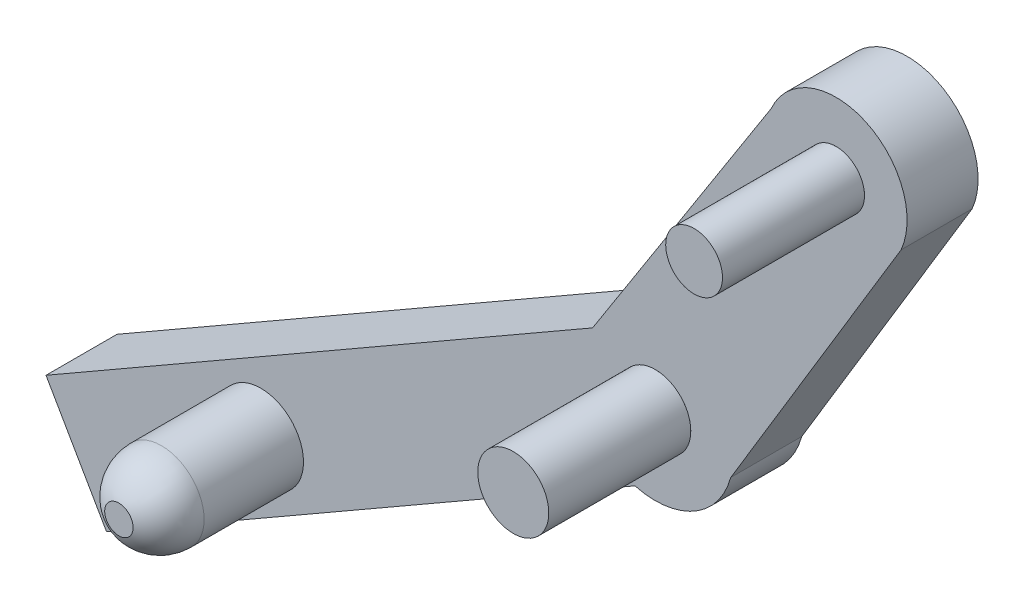
ISO-10303-21;
HEADER;
FILE_DESCRIPTION(('STEP AP214'),'2;1');
FILE_NAME('part.step','',(''),(''),'','','');
FILE_SCHEMA(('AUTOMOTIVE_DESIGN { 1 0 10303 214 1 1 1 1 }'));
ENDSEC;
DATA;
#1=APPLICATION_CONTEXT('core data for automotive mechanical design processes');
#2=APPLICATION_PROTOCOL_DEFINITION('international standard','automotive_design',2000,#1);
#3=PRODUCT_CONTEXT('',#1,'mechanical');
#4=PRODUCT('Part','Part','',(#3));
#5=PRODUCT_RELATED_PRODUCT_CATEGORY('part','',(#4));
#6=PRODUCT_DEFINITION_FORMATION('','',#4);
#7=PRODUCT_DEFINITION_CONTEXT('part definition',#1,'design');
#8=PRODUCT_DEFINITION('design','',#6,#7);
#9=PRODUCT_DEFINITION_SHAPE('','',#8);
#10=(LENGTH_UNIT() NAMED_UNIT(*) SI_UNIT(.MILLI.,.METRE.));
#11=(NAMED_UNIT(*) PLANE_ANGLE_UNIT() SI_UNIT($,.RADIAN.));
#12=(NAMED_UNIT(*) SI_UNIT($,.STERADIAN.) SOLID_ANGLE_UNIT());
#13=UNCERTAINTY_MEASURE_WITH_UNIT(LENGTH_MEASURE(1.E-05),#10,'distance_accuracy_value','');
#14=(GEOMETRIC_REPRESENTATION_CONTEXT(3) GLOBAL_UNCERTAINTY_ASSIGNED_CONTEXT((#13)) GLOBAL_UNIT_ASSIGNED_CONTEXT((#10,
#11,#12)) REPRESENTATION_CONTEXT('',''));
#15=CARTESIAN_POINT('',(0.,0.,0.));
#16=DIRECTION('',(0.,0.,1.));
#17=DIRECTION('',(1.,0.,0.));
#18=AXIS2_PLACEMENT_3D('',#15,#16,#17);
#19=CARTESIAN_POINT('',(2.48034743292827,-4.35301832543163,10.));
#20=DIRECTION('',(0.,0.,-1.));
#21=DIRECTION('',(1.,0.,0.));
#22=AXIS2_PLACEMENT_3D('',#19,#20,#21);
#23=CYLINDRICAL_SURFACE('',#22,2.5);
#24=CARTESIAN_POINT('',(2.48034743292827,-4.35301832543163,10.));
#25=DIRECTION('',(0.,0.,-1.));
#26=DIRECTION('',(-1.,0.,0.));
#27=AXIS2_PLACEMENT_3D('',#24,#25,#26);
#28=CIRCLE('',#27,2.5);
#29=CARTESIAN_POINT('',(-0.019652567071734,-4.35301832543163,10.));
#30=VERTEX_POINT('',#29);
#31=EDGE_CURVE('E11',#30,#30,#28,.T.);
#32=ORIENTED_EDGE('',*,*,#31,.T.);
#33=EDGE_LOOP('',(#32));
#34=FACE_BOUND('',#33,.T.);
#35=CARTESIAN_POINT('',(2.48034743292827,-4.35301832543163,0.));
#36=DIRECTION('',(0.,0.,-1.));
#37=DIRECTION('',(-1.,0.,0.));
#38=AXIS2_PLACEMENT_3D('',#35,#36,#37);
#39=CIRCLE('',#38,2.5);
#40=CARTESIAN_POINT('',(-0.019652567071734,-4.35301832543163,0.));
#41=VERTEX_POINT('',#40);
#42=EDGE_CURVE('E49',#41,#41,#39,.T.);
#43=ORIENTED_EDGE('',*,*,#42,.F.);
#44=EDGE_LOOP('',(#43));
#45=FACE_BOUND('',#44,.T.);
#46=ADVANCED_FACE('F46',(#34,#45),#23,.T.);
#47=CARTESIAN_POINT('',(2.48034743292827,-4.35301832543163,10.));
#48=DIRECTION('',(0.,0.,1.));
#49=DIRECTION('',(-1.,0.,0.));
#50=AXIS2_PLACEMENT_3D('',#47,#48,#49);
#51=PLANE('',#50);
#52=ORIENTED_EDGE('',*,*,#31,.F.);
#53=EDGE_LOOP('',(#52));
#54=FACE_BOUND('',#53,.T.);
#55=ADVANCED_FACE('F61',(#54),#51,.T.);
#56=CARTESIAN_POINT('',(2.48034743292827,-4.35301832543163,0.));
#57=DIRECTION('',(0.,0.,1.));
#58=DIRECTION('',(-1.,0.,0.));
#59=AXIS2_PLACEMENT_3D('',#56,#57,#58);
#60=PLANE('',#59);
#61=ORIENTED_EDGE('',*,*,#42,.T.);
#62=EDGE_LOOP('',(#61));
#63=FACE_BOUND('',#62,.T.);
#64=ADVANCED_FACE('F58',(#63),#60,.F.);
#65=CLOSED_SHELL('',(#46,#55,#64));
#66=MANIFOLD_SOLID_BREP('B2',#65);
#67=CARTESIAN_POINT('',(15.213151988496,16.1187767320416,10.));
#68=DIRECTION('',(0.,0.,-1.));
#69=DIRECTION('',(1.,0.,0.));
#70=AXIS2_PLACEMENT_3D('',#67,#68,#69);
#71=CYLINDRICAL_SURFACE('',#70,2.00000000004588);
#72=CARTESIAN_POINT('',(15.213151988496,16.1187767320416,10.));
#73=DIRECTION('',(0.,0.,-1.));
#74=DIRECTION('',(-1.,0.,0.));
#75=AXIS2_PLACEMENT_3D('',#72,#73,#74);
#76=CIRCLE('',#75,2.00000000004588);
#77=CARTESIAN_POINT('',(13.2131519884501,16.1187767320416,10.));
#78=VERTEX_POINT('',#77);
#79=EDGE_CURVE('E45',#78,#78,#76,.T.);
#80=ORIENTED_EDGE('',*,*,#79,.T.);
#81=EDGE_LOOP('',(#80));
#82=FACE_BOUND('',#81,.T.);
#83=CARTESIAN_POINT('',(15.213151988496,16.1187767320416,0.));
#84=DIRECTION('',(0.,0.,-1.));
#85=DIRECTION('',(-1.,0.,0.));
#86=AXIS2_PLACEMENT_3D('',#83,#84,#85);
#87=CIRCLE('',#86,2.00000000004588);
#88=CARTESIAN_POINT('',(13.2131519884501,16.1187767320416,0.));
#89=VERTEX_POINT('',#88);
#90=EDGE_CURVE('E99',#89,#89,#87,.T.);
#91=ORIENTED_EDGE('',*,*,#90,.F.);
#92=EDGE_LOOP('',(#91));
#93=FACE_BOUND('',#92,.T.);
#94=ADVANCED_FACE('F96',(#82,#93),#71,.T.);
#95=CARTESIAN_POINT('',(15.213151988496,16.1187767320416,10.));
#96=DIRECTION('',(0.,0.,1.));
#97=DIRECTION('',(-1.,0.,0.));
#98=AXIS2_PLACEMENT_3D('',#95,#96,#97);
#99=PLANE('',#98);
#100=ORIENTED_EDGE('',*,*,#79,.F.);
#101=EDGE_LOOP('',(#100));
#102=FACE_BOUND('',#101,.T.);
#103=ADVANCED_FACE('F111',(#102),#99,.T.);
#104=CARTESIAN_POINT('',(15.213151988496,16.1187767320416,0.));
#105=DIRECTION('',(0.,0.,1.));
#106=DIRECTION('',(-1.,0.,0.));
#107=AXIS2_PLACEMENT_3D('',#104,#105,#106);
#108=PLANE('',#107);
#109=ORIENTED_EDGE('',*,*,#90,.T.);
#110=EDGE_LOOP('',(#109));
#111=FACE_BOUND('',#110,.T.);
#112=ADVANCED_FACE('F108',(#111),#108,.F.);
#113=CLOSED_SHELL('',(#94,#103,#112));
#114=MANIFOLD_SOLID_BREP('B6',#113);
#115=CARTESIAN_POINT('',(-25.2931810081454,-19.8826359089884,10.));
#116=DIRECTION('',(0.,0.,-1.));
#117=DIRECTION('',(1.,0.,0.));
#118=AXIS2_PLACEMENT_3D('',#115,#116,#117);
#119=CYLINDRICAL_SURFACE('',#118,3.00000000000002);
#120=CARTESIAN_POINT('',(-25.2931810081454,-19.8826359089884,0.));
#121=DIRECTION('',(0.,0.,1.));
#122=DIRECTION('',(1.,0.,0.));
#123=AXIS2_PLACEMENT_3D('',#120,#121,#122);
#124=CIRCLE('',#123,3.00000000000002);
#125=CARTESIAN_POINT('',(-22.2931810081454,-19.8826359089884,0.));
#126=VERTEX_POINT('',#125);
#127=EDGE_CURVE('E94',#126,#126,#124,.F.);
#128=ORIENTED_EDGE('',*,*,#127,.F.);
#129=EDGE_LOOP('',(#128));
#130=FACE_BOUND('',#129,.T.);
#131=CARTESIAN_POINT('',(-25.2931810081454,-19.8826359089884,7.));
#132=DIRECTION('',(0.,0.,-1.));
#133=DIRECTION('',(-1.,0.,0.));
#134=AXIS2_PLACEMENT_3D('',#131,#132,#133);
#135=CIRCLE('',#134,3.00000000000003);
#136=CARTESIAN_POINT('',(-28.2931810081454,-19.8826359089884,7.));
#137=VERTEX_POINT('',#136);
#138=EDGE_CURVE('E287',#137,#137,#135,.T.);
#139=ORIENTED_EDGE('',*,*,#138,.T.);
#140=EDGE_LOOP('',(#139));
#141=FACE_BOUND('',#140,.T.);
#142=ADVANCED_FACE('F137',(#130,#141),#119,.T.);
#143=CARTESIAN_POINT('',(-0.682703439514869,0.436635830889686,-5.));
#144=DIRECTION('',(-0.842436284988127,0.538795977838925,0.));
#145=DIRECTION('',(-0.538795977838925,-0.842436284988127,0.));
#146=AXIS2_PLACEMENT_3D('',#143,#144,#145);
#147=PLANE('',#146);
#148=DIRECTION('',(0.538795977838925,0.842436284988127,0.));
#149=VECTOR('',#148,1.);
#150=CARTESIAN_POINT('',(-0.682703439514869,0.436635830889686,0.));
#151=LINE('',#150,#149);
#152=CARTESIAN_POINT('',(-1.93424021867878,-1.52020875988425,0.));
#153=VERTEX_POINT('',#152);
#154=CARTESIAN_POINT('',(10.6400793801503,18.1404114466345,0.));
#155=VERTEX_POINT('',#154);
#156=EDGE_CURVE('E235',#153,#155,#151,.T.);
#157=ORIENTED_EDGE('',*,*,#156,.T.);
#158=DIRECTION('',(0.,0.,1.));
#159=VECTOR('',#158,1.);
#160=CARTESIAN_POINT('',(10.6400793801503,18.1404114466345,-5.));
#161=LINE('',#160,#159);
#162=CARTESIAN_POINT('',(10.6400793801503,18.1404114466345,-5.));
#163=VERTEX_POINT('',#162);
#164=EDGE_CURVE('E234',#163,#155,#161,.T.);
#165=ORIENTED_EDGE('',*,*,#164,.F.);
#166=DIRECTION('',(0.538795977838925,0.842436284988127,0.));
#167=VECTOR('',#166,1.);
#168=CARTESIAN_POINT('',(-0.682703439514869,0.436635830889686,-5.));
#169=LINE('',#168,#167);
#170=CARTESIAN_POINT('',(-1.93424021867878,-1.52020875988425,-5.));
#171=VERTEX_POINT('',#170);
#172=EDGE_CURVE('E257',#171,#163,#169,.T.);
#173=ORIENTED_EDGE('',*,*,#172,.F.);
#174=DIRECTION('',(0.,0.,1.));
#175=VECTOR('',#174,1.);
#176=CARTESIAN_POINT('',(-1.93424021867878,-1.52020875988425,-5.));
#177=LINE('',#176,#175);
#178=EDGE_CURVE('E146',#171,#153,#177,.T.);
#179=ORIENTED_EDGE('',*,*,#178,.T.);
#180=EDGE_LOOP('',(#157,#165,#173,#179));
#181=FACE_BOUND('',#180,.T.);
#182=ADVANCED_FACE('F139',(#181),#147,.T.);
#183=CARTESIAN_POINT('',(0.17625658415401,-0.30648591573246,-5.));
#184=DIRECTION('',(-0.498528903536302,0.866873077410351,0.));
#185=DIRECTION('',(-0.866873077410351,-0.498528903536302,0.));
#186=AXIS2_PLACEMENT_3D('',#183,#184,#185);
#187=PLANE('',#186);
#188=DIRECTION('',(0.866873077410351,0.498528903536302,0.));
#189=VECTOR('',#188,1.);
#190=CARTESIAN_POINT('',(0.17625658415401,-0.30648591573246,0.));
#191=LINE('',#190,#189);
#192=CARTESIAN_POINT('',(-40.4263847840177,-23.6566057999731,0.));
#193=VERTEX_POINT('',#192);
#194=EDGE_CURVE('E238',#193,#153,#191,.T.);
#195=ORIENTED_EDGE('',*,*,#194,.T.);
#196=ORIENTED_EDGE('',*,*,#178,.F.);
#197=DIRECTION('',(0.866873077410351,0.498528903536302,0.));
#198=VECTOR('',#197,1.);
#199=CARTESIAN_POINT('',(0.17625658415401,-0.30648591573246,-5.));
#200=LINE('',#199,#198);
#201=CARTESIAN_POINT('',(-40.4263847840177,-23.6566057999731,-5.));
#202=VERTEX_POINT('',#201);
#203=EDGE_CURVE('E189',#202,#171,#200,.T.);
#204=ORIENTED_EDGE('',*,*,#203,.F.);
#205=DIRECTION('',(0.,0.,1.));
#206=VECTOR('',#205,1.);
#207=CARTESIAN_POINT('',(-40.4263847840177,-23.6566057999731,-5.));
#208=LINE('',#207,#206);
#209=EDGE_CURVE('E264',#202,#193,#208,.T.);
#210=ORIENTED_EDGE('',*,*,#209,.T.);
#211=EDGE_LOOP('',(#195,#196,#204,#210));
#212=FACE_BOUND('',#211,.T.);
#213=ADVANCED_FACE('F274',(#212),#187,.T.);
#214=CARTESIAN_POINT('',(-40.6026413681717,-23.3501198842406,-5.));
#215=DIRECTION('',(0.866873077410351,0.498528903536302,0.));
#216=DIRECTION('',(-0.498528903536302,0.866873077410351,0.));
#217=AXIS2_PLACEMENT_3D('',#214,#215,#216);
#218=PLANE('',#217);
#219=DIRECTION('',(0.498528903536302,-0.866873077410351,0.));
#220=VECTOR('',#219,1.);
#221=CARTESIAN_POINT('',(-40.6026413681717,-23.3501198842406,0.));
#222=LINE('',#221,#220);
#223=CARTESIAN_POINT('',(-36.1661695545836,-31.0645331240926,0.));
#224=VERTEX_POINT('',#223);
#225=EDGE_CURVE('E241',#193,#224,#222,.T.);
#226=ORIENTED_EDGE('',*,*,#225,.F.);
#227=ORIENTED_EDGE('',*,*,#209,.F.);
#228=DIRECTION('',(0.498528903536302,-0.866873077410351,0.));
#229=VECTOR('',#228,1.);
#230=CARTESIAN_POINT('',(-40.6026413681717,-23.3501198842406,-5.));
#231=LINE('',#230,#229);
#232=CARTESIAN_POINT('',(-36.1661695545836,-31.0645331240926,-5.));
#233=VERTEX_POINT('',#232);
#234=EDGE_CURVE('E223',#202,#233,#231,.T.);
#235=ORIENTED_EDGE('',*,*,#234,.T.);
#236=DIRECTION('',(0.,0.,1.));
#237=VECTOR('',#236,1.);
#238=CARTESIAN_POINT('',(-36.1661695545836,-31.0645331240926,-5.));
#239=LINE('',#238,#237);
#240=EDGE_CURVE('E261',#233,#224,#239,.T.);
#241=ORIENTED_EDGE('',*,*,#240,.T.);
#242=EDGE_LOOP('',(#226,#227,#235,#241));
#243=FACE_BOUND('',#242,.T.);
#244=ADVANCED_FACE('F278',(#243),#218,.F.);
#245=CARTESIAN_POINT('',(4.43647181358803,-7.71441323985198,-5.));
#246=DIRECTION('',(-0.498528903536302,0.866873077410351,0.));
#247=DIRECTION('',(-0.866873077410351,-0.498528903536302,0.));
#248=AXIS2_PLACEMENT_3D('',#245,#246,#247);
#249=PLANE('',#248);
#250=DIRECTION('',(0.866873077410351,0.498528903536302,0.));
#251=VECTOR('',#250,1.);
#252=CARTESIAN_POINT('',(4.43647181358803,-7.71441323985198,0.));
#253=LINE('',#252,#251);
#254=CARTESIAN_POINT('',(1.04782478556533,-9.66318582418271,0.));
#255=VERTEX_POINT('',#254);
#256=EDGE_CURVE('E244',#224,#255,#253,.T.);
#257=ORIENTED_EDGE('',*,*,#256,.F.);
#258=ORIENTED_EDGE('',*,*,#240,.F.);
#259=DIRECTION('',(0.866873077410351,0.498528903536302,0.));
#260=VECTOR('',#259,1.);
#261=CARTESIAN_POINT('',(4.43647181358803,-7.71441323985198,-5.));
#262=LINE('',#261,#260);
#263=CARTESIAN_POINT('',(1.04782478556533,-9.66318582418271,-5.));
#264=VERTEX_POINT('',#263);
#265=EDGE_CURVE('E221',#233,#264,#262,.T.);
#266=ORIENTED_EDGE('',*,*,#265,.T.);
#267=DIRECTION('',(0.,0.,1.));
#268=VECTOR('',#267,1.);
#269=CARTESIAN_POINT('',(1.04782478556533,-9.66318582418271,-5.));
#270=LINE('',#269,#268);
#271=EDGE_CURVE('E215',#264,#255,#270,.T.);
#272=ORIENTED_EDGE('',*,*,#271,.T.);
#273=EDGE_LOOP('',(#257,#258,#266,#272));
#274=FACE_BOUND('',#273,.T.);
#275=ADVANCED_FACE('F281',(#274),#249,.F.);
#276=CARTESIAN_POINT('',(2.48034743292827,-4.35301832543163,-5.));
#277=DIRECTION('',(0.,0.,1.));
#278=DIRECTION('',(-1.,0.,0.));
#279=AXIS2_PLACEMENT_3D('',#276,#277,#278);
#280=CYLINDRICAL_SURFACE('',#279,5.5);
#281=CARTESIAN_POINT('',(2.48034743292827,-4.35301832543163,0.));
#282=DIRECTION('',(0.,0.,1.));
#283=DIRECTION('',(1.,0.,0.));
#284=AXIS2_PLACEMENT_3D('',#281,#282,#283);
#285=CIRCLE('',#284,5.5);
#286=CARTESIAN_POINT('',(7.79051493167935,-5.78554097279456,0.));
#287=VERTEX_POINT('',#286);
#288=EDGE_CURVE('E247',#255,#287,#285,.T.);
#289=ORIENTED_EDGE('',*,*,#288,.F.);
#290=ORIENTED_EDGE('',*,*,#271,.F.);
#291=CARTESIAN_POINT('',(2.48034743292827,-4.35301832543163,-5.));
#292=DIRECTION('',(0.,0.,1.));
#293=DIRECTION('',(1.,0.,0.));
#294=AXIS2_PLACEMENT_3D('',#291,#292,#293);
#295=CIRCLE('',#294,5.5);
#296=CARTESIAN_POINT('',(7.79051493167935,-5.78554097279456,-5.));
#297=VERTEX_POINT('',#296);
#298=EDGE_CURVE('E205',#264,#297,#295,.T.);
#299=ORIENTED_EDGE('',*,*,#298,.T.);
#300=DIRECTION('',(0.,0.,1.));
#301=VECTOR('',#300,1.);
#302=CARTESIAN_POINT('',(7.79051493167935,-5.78554097279456,-5.));
#303=LINE('',#302,#301);
#304=EDGE_CURVE('E210',#297,#287,#303,.T.);
#305=ORIENTED_EDGE('',*,*,#304,.T.);
#306=EDGE_LOOP('',(#289,#290,#299,#305));
#307=FACE_BOUND('',#306,.T.);
#308=ADVANCED_FACE('F218',(#307),#280,.T.);
#309=CARTESIAN_POINT('',(8.27057905312399,-4.98984292672802,-5.));
#310=DIRECTION('',(-0.856234541670631,0.51658727205583,0.));
#311=DIRECTION('',(-0.51658727205583,-0.856234541670632,0.));
#312=AXIS2_PLACEMENT_3D('',#309,#310,#311);
#313=PLANE('',#312);
#314=DIRECTION('',(0.51658727205583,0.856234541670631,0.));
#315=VECTOR('',#314,1.);
#316=CARTESIAN_POINT('',(8.27057905312399,-4.98984292672802,0.));
#317=LINE('',#316,#315);
#318=CARTESIAN_POINT('',(19.7862245967424,14.097142017446,0.));
#319=VERTEX_POINT('',#318);
#320=EDGE_CURVE('E212',#287,#319,#317,.T.);
#321=ORIENTED_EDGE('',*,*,#320,.F.);
#322=ORIENTED_EDGE('',*,*,#304,.F.);
#323=DIRECTION('',(0.51658727205583,0.856234541670631,0.));
#324=VECTOR('',#323,1.);
#325=CARTESIAN_POINT('',(8.27057905312399,-4.98984292672802,-5.));
#326=LINE('',#325,#324);
#327=CARTESIAN_POINT('',(19.7862245967424,14.097142017446,-5.));
#328=VERTEX_POINT('',#327);
#329=EDGE_CURVE('E200',#297,#328,#326,.T.);
#330=ORIENTED_EDGE('',*,*,#329,.T.);
#331=DIRECTION('',(0.,0.,1.));
#332=VECTOR('',#331,1.);
#333=CARTESIAN_POINT('',(19.7862245967424,14.097142017446,-5.));
#334=LINE('',#333,#332);
#335=EDGE_CURVE('E216',#328,#319,#334,.T.);
#336=ORIENTED_EDGE('',*,*,#335,.T.);
#337=EDGE_LOOP('',(#321,#322,#330,#336));
#338=FACE_BOUND('',#337,.T.);
#339=ADVANCED_FACE('F211',(#338),#313,.F.);
#340=CARTESIAN_POINT('',(15.2131519884464,16.1187767320402,-5.));
#341=DIRECTION('',(0.,0.,1.));
#342=DIRECTION('',(-1.,0.,0.));
#343=AXIS2_PLACEMENT_3D('',#340,#341,#342);
#344=CYLINDRICAL_SURFACE('',#343,2.);
#345=CARTESIAN_POINT('',(15.2131519884464,16.1187767320402,-5.));
#346=DIRECTION('',(0.,0.,1.));
#347=DIRECTION('',(1.,0.,0.));
#348=AXIS2_PLACEMENT_3D('',#345,#346,#347);
#349=CIRCLE('',#348,2.);
#350=CARTESIAN_POINT('',(17.2131519884464,16.1187767320402,-5.));
#351=VERTEX_POINT('',#350);
#352=EDGE_CURVE('E228',#351,#351,#349,.T.);
#353=ORIENTED_EDGE('',*,*,#352,.F.);
#354=EDGE_LOOP('',(#353));
#355=FACE_BOUND('',#354,.T.);
#356=CARTESIAN_POINT('',(15.2131519884464,16.1187767320402,0.));
#357=DIRECTION('',(0.,0.,1.));
#358=DIRECTION('',(1.,0.,0.));
#359=AXIS2_PLACEMENT_3D('',#356,#357,#358);
#360=CIRCLE('',#359,2.);
#361=CARTESIAN_POINT('',(17.2131519884464,16.1187767320402,0.));
#362=VERTEX_POINT('',#361);
#363=EDGE_CURVE('E251',#362,#362,#360,.T.);
#364=ORIENTED_EDGE('',*,*,#363,.T.);
#365=EDGE_LOOP('',(#364));
#366=FACE_BOUND('',#365,.T.);
#367=ADVANCED_FACE('F321',(#355,#366),#344,.F.);
#368=CARTESIAN_POINT('',(15.2131519884464,16.1187767320402,-5.));
#369=DIRECTION('',(0.,0.,1.));
#370=DIRECTION('',(-1.,0.,0.));
#371=AXIS2_PLACEMENT_3D('',#368,#369,#370);
#372=CYLINDRICAL_SURFACE('',#371,5.);
#373=CARTESIAN_POINT('',(15.2131519884464,16.1187767320402,0.));
#374=DIRECTION('',(0.,0.,1.));
#375=DIRECTION('',(1.,0.,0.));
#376=AXIS2_PLACEMENT_3D('',#373,#374,#375);
#377=CIRCLE('',#376,5.);
#378=EDGE_CURVE('E177',#319,#155,#377,.T.);
#379=ORIENTED_EDGE('',*,*,#378,.F.);
#380=ORIENTED_EDGE('',*,*,#335,.F.);
#381=CARTESIAN_POINT('',(15.2131519884464,16.1187767320402,-5.));
#382=DIRECTION('',(0.,0.,1.));
#383=DIRECTION('',(1.,0.,0.));
#384=AXIS2_PLACEMENT_3D('',#381,#382,#383);
#385=CIRCLE('',#384,5.);
#386=EDGE_CURVE('E154',#328,#163,#385,.T.);
#387=ORIENTED_EDGE('',*,*,#386,.T.);
#388=ORIENTED_EDGE('',*,*,#164,.T.);
#389=EDGE_LOOP('',(#379,#380,#387,#388));
#390=FACE_BOUND('',#389,.T.);
#391=ADVANCED_FACE('F319',(#390),#372,.T.);
#392=CARTESIAN_POINT('',(2.48034743292827,-4.35301832543163,-5.));
#393=DIRECTION('',(0.,0.,1.));
#394=DIRECTION('',(-1.,0.,0.));
#395=AXIS2_PLACEMENT_3D('',#392,#393,#394);
#396=CYLINDRICAL_SURFACE('',#395,2.5);
#397=CARTESIAN_POINT('',(2.48034743292827,-4.35301832543163,-5.));
#398=DIRECTION('',(0.,0.,1.));
#399=DIRECTION('',(1.,0.,0.));
#400=AXIS2_PLACEMENT_3D('',#397,#398,#399);
#401=CIRCLE('',#400,2.5);
#402=CARTESIAN_POINT('',(4.98034743292827,-4.35301832543163,-5.));
#403=VERTEX_POINT('',#402);
#404=EDGE_CURVE('E231',#403,#403,#401,.T.);
#405=ORIENTED_EDGE('',*,*,#404,.F.);
#406=EDGE_LOOP('',(#405));
#407=FACE_BOUND('',#406,.T.);
#408=CARTESIAN_POINT('',(2.48034743292827,-4.35301832543163,0.));
#409=DIRECTION('',(0.,0.,1.));
#410=DIRECTION('',(1.,0.,0.));
#411=AXIS2_PLACEMENT_3D('',#408,#409,#410);
#412=CIRCLE('',#411,2.5);
#413=CARTESIAN_POINT('',(4.98034743292827,-4.35301832543163,0.));
#414=VERTEX_POINT('',#413);
#415=EDGE_CURVE('E254',#414,#414,#412,.T.);
#416=ORIENTED_EDGE('',*,*,#415,.T.);
#417=EDGE_LOOP('',(#416));
#418=FACE_BOUND('',#417,.T.);
#419=ADVANCED_FACE('F313',(#407,#418),#396,.F.);
#420=CARTESIAN_POINT('',(0.,0.,-5.));
#421=DIRECTION('',(0.,0.,-1.));
#422=DIRECTION('',(1.,0.,0.));
#423=AXIS2_PLACEMENT_3D('',#420,#421,#422);
#424=PLANE('',#423);
#425=ORIENTED_EDGE('',*,*,#172,.T.);
#426=ORIENTED_EDGE('',*,*,#386,.F.);
#427=ORIENTED_EDGE('',*,*,#329,.F.);
#428=ORIENTED_EDGE('',*,*,#298,.F.);
#429=ORIENTED_EDGE('',*,*,#265,.F.);
#430=ORIENTED_EDGE('',*,*,#234,.F.);
#431=ORIENTED_EDGE('',*,*,#203,.T.);
#432=EDGE_LOOP('',(#425,#426,#427,#428,#429,#430,#431));
#433=FACE_BOUND('',#432,.T.);
#434=ORIENTED_EDGE('',*,*,#352,.T.);
#435=EDGE_LOOP('',(#434));
#436=FACE_BOUND('',#435,.T.);
#437=ORIENTED_EDGE('',*,*,#404,.T.);
#438=EDGE_LOOP('',(#437));
#439=FACE_BOUND('',#438,.T.);
#440=ADVANCED_FACE('F202',(#433,#436,#439),#424,.T.);
#441=CARTESIAN_POINT('',(0.,0.,0.));
#442=DIRECTION('',(0.,0.,-1.));
#443=DIRECTION('',(1.,0.,0.));
#444=AXIS2_PLACEMENT_3D('',#441,#442,#443);
#445=PLANE('',#444);
#446=ORIENTED_EDGE('',*,*,#127,.T.);
#447=EDGE_LOOP('',(#446));
#448=FACE_BOUND('',#447,.T.);
#449=ORIENTED_EDGE('',*,*,#156,.F.);
#450=ORIENTED_EDGE('',*,*,#194,.F.);
#451=ORIENTED_EDGE('',*,*,#225,.T.);
#452=ORIENTED_EDGE('',*,*,#256,.T.);
#453=ORIENTED_EDGE('',*,*,#288,.T.);
#454=ORIENTED_EDGE('',*,*,#320,.T.);
#455=ORIENTED_EDGE('',*,*,#378,.T.);
#456=EDGE_LOOP('',(#449,#450,#451,#452,#453,#454,#455));
#457=FACE_BOUND('',#456,.T.);
#458=ORIENTED_EDGE('',*,*,#363,.F.);
#459=EDGE_LOOP('',(#458));
#460=FACE_BOUND('',#459,.T.);
#461=ORIENTED_EDGE('',*,*,#415,.F.);
#462=EDGE_LOOP('',(#461));
#463=FACE_BOUND('',#462,.T.);
#464=ADVANCED_FACE('F272',(#448,#457,#460,#463),#445,.F.);
#465=CARTESIAN_POINT('',(-25.2931810081454,-19.8826359089884,7.));
#466=DIRECTION('',(0.,0.,1.));
#467=DIRECTION('',(-1.,0.,0.));
#468=AXIS2_PLACEMENT_3D('',#465,#466,#467);
#469=DEGENERATE_TOROIDAL_SURFACE('',#468,0.249999999999958,3.24999999999998,.F.);
#470=ORIENTED_EDGE('',*,*,#138,.F.);
#471=EDGE_LOOP('',(#470));
#472=FACE_BOUND('',#471,.T.);
#473=CARTESIAN_POINT('',(-25.2931810081454,-19.8826359089884,10.));
#474=DIRECTION('',(0.,0.,-1.));
#475=DIRECTION('',(-1.,0.,0.));
#476=AXIS2_PLACEMENT_3D('',#473,#474,#475);
#477=CIRCLE('',#476,1.);
#478=CARTESIAN_POINT('',(-26.2931810081454,-19.8826359089884,10.));
#479=VERTEX_POINT('',#478);
#480=EDGE_CURVE('E239',#479,#479,#477,.T.);
#481=ORIENTED_EDGE('',*,*,#480,.T.);
#482=EDGE_LOOP('',(#481));
#483=FACE_BOUND('',#482,.T.);
#484=ADVANCED_FACE('F292',(#472,#483),#469,.F.);
#485=CARTESIAN_POINT('',(-25.2931810081454,-19.8826359089884,10.));
#486=DIRECTION('',(0.,0.,1.));
#487=DIRECTION('',(-1.,0.,0.));
#488=AXIS2_PLACEMENT_3D('',#485,#486,#487);
#489=PLANE('',#488);
#490=ORIENTED_EDGE('',*,*,#480,.F.);
#491=EDGE_LOOP('',(#490));
#492=FACE_BOUND('',#491,.T.);
#493=ADVANCED_FACE('F295',(#492),#489,.T.);
#494=CLOSED_SHELL('',(#142,#182,#213,#244,#275,#308,#339,#367,#391,#419,#440,#464,#484,#493));
#495=MANIFOLD_SOLID_BREP('B40',#494);
#496=ADVANCED_BREP_SHAPE_REPRESENTATION('',(#18,#66,#114,#495),#14);
#497=SHAPE_DEFINITION_REPRESENTATION(#9,#496);
ENDSEC;
END-ISO-10303-21;
